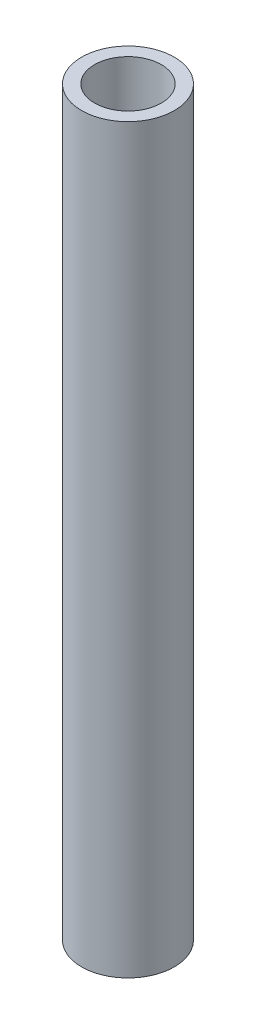
ISO-10303-21;
HEADER;
FILE_DESCRIPTION(('STEP AP214'),'2;1');
FILE_NAME('part.step','',(''),(''),'','','');
FILE_SCHEMA(('AUTOMOTIVE_DESIGN { 1 0 10303 214 1 1 1 1 }'));
ENDSEC;
DATA;
#1=APPLICATION_CONTEXT('core data for automotive mechanical design processes');
#2=APPLICATION_PROTOCOL_DEFINITION('international standard','automotive_design',2000,#1);
#3=PRODUCT_CONTEXT('',#1,'mechanical');
#4=PRODUCT('Part','Part','',(#3));
#5=PRODUCT_RELATED_PRODUCT_CATEGORY('part','',(#4));
#6=PRODUCT_DEFINITION_FORMATION('','',#4);
#7=PRODUCT_DEFINITION_CONTEXT('part definition',#1,'design');
#8=PRODUCT_DEFINITION('design','',#6,#7);
#9=PRODUCT_DEFINITION_SHAPE('','',#8);
#10=(LENGTH_UNIT() NAMED_UNIT(*) SI_UNIT(.MILLI.,.METRE.));
#11=(NAMED_UNIT(*) PLANE_ANGLE_UNIT() SI_UNIT($,.RADIAN.));
#12=(NAMED_UNIT(*) SI_UNIT($,.STERADIAN.) SOLID_ANGLE_UNIT());
#13=UNCERTAINTY_MEASURE_WITH_UNIT(LENGTH_MEASURE(1.E-05),#10,'distance_accuracy_value','');
#14=(GEOMETRIC_REPRESENTATION_CONTEXT(3) GLOBAL_UNCERTAINTY_ASSIGNED_CONTEXT((#13)) GLOBAL_UNIT_ASSIGNED_CONTEXT((#10,
#11,#12)) REPRESENTATION_CONTEXT('',''));
#15=CARTESIAN_POINT('',(0.,0.,0.));
#16=DIRECTION('',(0.,0.,1.));
#17=DIRECTION('',(1.,0.,0.));
#18=AXIS2_PLACEMENT_3D('',#15,#16,#17);
#19=CARTESIAN_POINT('',(0.,50.8,0.));
#20=DIRECTION('',(0.,1.,0.));
#21=DIRECTION('',(0.,0.,1.));
#22=AXIS2_PLACEMENT_3D('',#19,#20,#21);
#23=PLANE('',#22);
#24=CARTESIAN_POINT('',(0.,50.8,0.));
#25=DIRECTION('',(0.,1.,0.));
#26=DIRECTION('',(0.,0.,1.));
#27=AXIS2_PLACEMENT_3D('',#24,#25,#26);
#28=CIRCLE('',#27,3.175);
#29=CARTESIAN_POINT('',(0.,50.8,3.175));
#30=VERTEX_POINT('',#29);
#31=EDGE_CURVE('E10',#30,#30,#28,.T.);
#32=ORIENTED_EDGE('',*,*,#31,.T.);
#33=EDGE_LOOP('',(#32));
#34=FACE_BOUND('',#33,.T.);
#35=CARTESIAN_POINT('',(0.,50.8,0.));
#36=DIRECTION('',(0.,1.,0.));
#37=DIRECTION('',(0.,0.,1.));
#38=AXIS2_PLACEMENT_3D('',#35,#36,#37);
#39=CIRCLE('',#38,2.286);
#40=CARTESIAN_POINT('',(0.,50.8,2.286));
#41=VERTEX_POINT('',#40);
#42=EDGE_CURVE('E42',#41,#41,#39,.T.);
#43=ORIENTED_EDGE('',*,*,#42,.F.);
#44=EDGE_LOOP('',(#43));
#45=FACE_BOUND('',#44,.T.);
#46=ADVANCED_FACE('F31',(#34,#45),#23,.T.);
#47=CARTESIAN_POINT('',(0.,0.,0.));
#48=DIRECTION('',(0.,1.,0.));
#49=DIRECTION('',(0.,0.,1.));
#50=AXIS2_PLACEMENT_3D('',#47,#48,#49);
#51=PLANE('',#50);
#52=CARTESIAN_POINT('',(0.,0.,0.));
#53=DIRECTION('',(0.,1.,0.));
#54=DIRECTION('',(0.,0.,1.));
#55=AXIS2_PLACEMENT_3D('',#52,#53,#54);
#56=CIRCLE('',#55,3.175);
#57=CARTESIAN_POINT('',(0.,0.,3.175));
#58=VERTEX_POINT('',#57);
#59=EDGE_CURVE('E35',#58,#58,#56,.T.);
#60=ORIENTED_EDGE('',*,*,#59,.F.);
#61=EDGE_LOOP('',(#60));
#62=FACE_BOUND('',#61,.T.);
#63=CARTESIAN_POINT('',(0.,0.,0.));
#64=DIRECTION('',(0.,1.,0.));
#65=DIRECTION('',(0.,0.,1.));
#66=AXIS2_PLACEMENT_3D('',#63,#64,#65);
#67=CIRCLE('',#66,2.286);
#68=CARTESIAN_POINT('',(0.,0.,2.286));
#69=VERTEX_POINT('',#68);
#70=EDGE_CURVE('E44',#69,#69,#67,.T.);
#71=ORIENTED_EDGE('',*,*,#70,.T.);
#72=EDGE_LOOP('',(#71));
#73=FACE_BOUND('',#72,.T.);
#74=ADVANCED_FACE('F54',(#62,#73),#51,.F.);
#75=CARTESIAN_POINT('',(0.,50.8,0.));
#76=DIRECTION('',(0.,-1.,0.));
#77=DIRECTION('',(0.,0.,-1.));
#78=AXIS2_PLACEMENT_3D('',#75,#76,#77);
#79=CYLINDRICAL_SURFACE('',#78,3.175);
#80=ORIENTED_EDGE('',*,*,#31,.F.);
#81=EDGE_LOOP('',(#80));
#82=FACE_BOUND('',#81,.T.);
#83=ORIENTED_EDGE('',*,*,#59,.T.);
#84=EDGE_LOOP('',(#83));
#85=FACE_BOUND('',#84,.T.);
#86=ADVANCED_FACE('F33',(#82,#85),#79,.T.);
#87=CARTESIAN_POINT('',(0.,50.8,0.));
#88=DIRECTION('',(0.,-1.,0.));
#89=DIRECTION('',(0.,0.,-1.));
#90=AXIS2_PLACEMENT_3D('',#87,#88,#89);
#91=CYLINDRICAL_SURFACE('',#90,2.286);
#92=ORIENTED_EDGE('',*,*,#42,.T.);
#93=EDGE_LOOP('',(#92));
#94=FACE_BOUND('',#93,.T.);
#95=ORIENTED_EDGE('',*,*,#70,.F.);
#96=EDGE_LOOP('',(#95));
#97=FACE_BOUND('',#96,.T.);
#98=ADVANCED_FACE('F50',(#94,#97),#91,.F.);
#99=CLOSED_SHELL('',(#46,#74,#86,#98));
#100=MANIFOLD_SOLID_BREP('B2',#99);
#101=ADVANCED_BREP_SHAPE_REPRESENTATION('',(#18,#100),#14);
#102=SHAPE_DEFINITION_REPRESENTATION(#9,#101);
ENDSEC;
END-ISO-10303-21;
